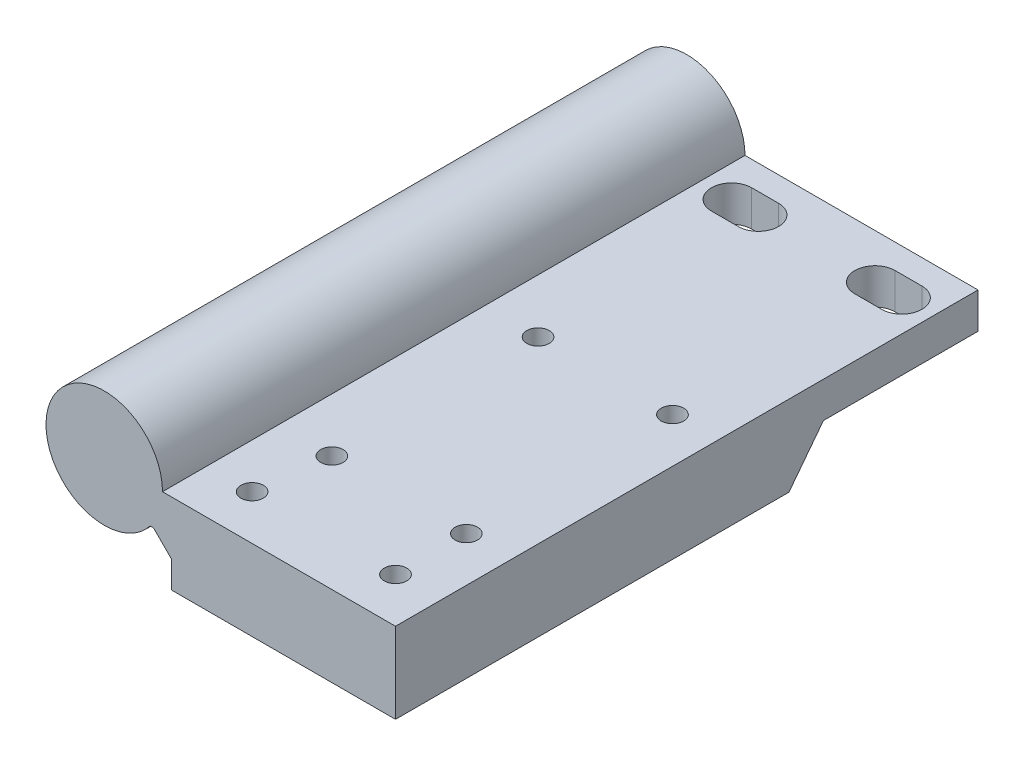
ISO-10303-21;
HEADER;
FILE_DESCRIPTION(('STEP AP214'),'2;1');
FILE_NAME('part.step','',(''),(''),'','','');
FILE_SCHEMA(('AUTOMOTIVE_DESIGN { 1 0 10303 214 1 1 1 1 }'));
ENDSEC;
DATA;
#1=APPLICATION_CONTEXT('core data for automotive mechanical design processes');
#2=APPLICATION_PROTOCOL_DEFINITION('international standard','automotive_design',2000,#1);
#3=PRODUCT_CONTEXT('',#1,'mechanical');
#4=PRODUCT('Part','Part','',(#3));
#5=PRODUCT_RELATED_PRODUCT_CATEGORY('part','',(#4));
#6=PRODUCT_DEFINITION_FORMATION('','',#4);
#7=PRODUCT_DEFINITION_CONTEXT('part definition',#1,'design');
#8=PRODUCT_DEFINITION('design','',#6,#7);
#9=PRODUCT_DEFINITION_SHAPE('','',#8);
#10=(LENGTH_UNIT() NAMED_UNIT(*) SI_UNIT(.MILLI.,.METRE.));
#11=(NAMED_UNIT(*) PLANE_ANGLE_UNIT() SI_UNIT($,.RADIAN.));
#12=(NAMED_UNIT(*) SI_UNIT($,.STERADIAN.) SOLID_ANGLE_UNIT());
#13=UNCERTAINTY_MEASURE_WITH_UNIT(LENGTH_MEASURE(1.E-05),#10,'distance_accuracy_value','');
#14=(GEOMETRIC_REPRESENTATION_CONTEXT(3) GLOBAL_UNCERTAINTY_ASSIGNED_CONTEXT((#13)) GLOBAL_UNIT_ASSIGNED_CONTEXT((#10,
#11,#12)) REPRESENTATION_CONTEXT('',''));
#15=CARTESIAN_POINT('',(0.,0.,0.));
#16=DIRECTION('',(0.,0.,1.));
#17=DIRECTION('',(1.,0.,0.));
#18=AXIS2_PLACEMENT_3D('',#15,#16,#17);
#19=CARTESIAN_POINT('',(0.,0.,65.));
#20=DIRECTION('',(0.,0.,-1.));
#21=DIRECTION('',(-1.,0.,0.));
#22=AXIS2_PLACEMENT_3D('',#19,#20,#21);
#23=CYLINDRICAL_SURFACE('',#22,4.1);
#24=CARTESIAN_POINT('',(0.,0.,0.));
#25=DIRECTION('',(0.,0.,1.));
#26=DIRECTION('',(1.,0.,0.));
#27=AXIS2_PLACEMENT_3D('',#24,#25,#26);
#28=CIRCLE('',#27,4.1);
#29=CARTESIAN_POINT('',(4.1,0.,0.));
#30=VERTEX_POINT('',#29);
#31=EDGE_CURVE('E276',#30,#30,#28,.T.);
#32=ORIENTED_EDGE('',*,*,#31,.F.);
#33=EDGE_LOOP('',(#32));
#34=FACE_BOUND('',#33,.T.);
#35=CARTESIAN_POINT('',(0.,0.,62.));
#36=DIRECTION('',(0.,0.,1.));
#37=DIRECTION('',(1.,0.,0.));
#38=AXIS2_PLACEMENT_3D('',#35,#36,#37);
#39=CIRCLE('',#38,4.1);
#40=CARTESIAN_POINT('',(4.1,0.,62.));
#41=VERTEX_POINT('',#40);
#42=EDGE_CURVE('E275',#41,#41,#39,.T.);
#43=ORIENTED_EDGE('',*,*,#42,.T.);
#44=EDGE_LOOP('',(#43));
#45=FACE_BOUND('',#44,.T.);
#46=ADVANCED_FACE('F44',(#34,#45),#23,.F.);
#47=CARTESIAN_POINT('',(0.,0.,65.));
#48=DIRECTION('',(0.,0.,1.));
#49=DIRECTION('',(1.,0.,0.));
#50=AXIS2_PLACEMENT_3D('',#47,#48,#49);
#51=PLANE('',#50);
#52=CARTESIAN_POINT('',(0.,0.,65.));
#53=DIRECTION('',(0.,0.,1.));
#54=DIRECTION('',(1.,0.,0.));
#55=AXIS2_PLACEMENT_3D('',#52,#53,#54);
#56=CIRCLE('',#55,6.5);
#57=CARTESIAN_POINT('',(6.5,0.,65.));
#58=VERTEX_POINT('',#57);
#59=CARTESIAN_POINT('',(5.1234753829798,-4.,65.));
#60=VERTEX_POINT('',#59);
#61=EDGE_CURVE('E280',#58,#60,#56,.T.);
#62=ORIENTED_EDGE('',*,*,#61,.T.);
#63=DIRECTION('',(1.,0.,0.));
#64=VECTOR('',#63,1.);
#65=CARTESIAN_POINT('',(5.1234753829798,-4.,65.));
#66=LINE('',#65,#64);
#67=CARTESIAN_POINT('',(5.500000000044,-4.,65.));
#68=VERTEX_POINT('',#67);
#69=EDGE_CURVE('E168',#60,#68,#66,.T.);
#70=ORIENTED_EDGE('',*,*,#69,.T.);
#71=DIRECTION('',(-0.707106781186551,0.707106781186544,0.));
#72=VECTOR('',#71,1.);
#73=CARTESIAN_POINT('',(5.500000000044,-4.,65.));
#74=LINE('',#73,#72);
#75=CARTESIAN_POINT('',(7.5,-5.99999999995599,65.));
#76=VERTEX_POINT('',#75);
#77=EDGE_CURVE('E53',#68,#76,#74,.F.);
#78=ORIENTED_EDGE('',*,*,#77,.T.);
#79=DIRECTION('',(0.,-1.,0.));
#80=VECTOR('',#79,1.);
#81=CARTESIAN_POINT('',(7.5,-8.99999999991197,65.));
#82=LINE('',#81,#80);
#83=CARTESIAN_POINT('',(7.5,-8.99999999991197,65.));
#84=VERTEX_POINT('',#83);
#85=EDGE_CURVE('E174',#76,#84,#82,.T.);
#86=ORIENTED_EDGE('',*,*,#85,.T.);
#87=DIRECTION('',(1.,0.,0.));
#88=VECTOR('',#87,1.);
#89=CARTESIAN_POINT('',(7.5,-8.99999999991197,65.));
#90=LINE('',#89,#88);
#91=CARTESIAN_POINT('',(32.5,-8.99999999991197,65.));
#92=VERTEX_POINT('',#91);
#93=EDGE_CURVE('E171',#84,#92,#90,.T.);
#94=ORIENTED_EDGE('',*,*,#93,.T.);
#95=DIRECTION('',(0.,1.,0.));
#96=VECTOR('',#95,1.);
#97=CARTESIAN_POINT('',(32.5,-4.,65.));
#98=LINE('',#97,#96);
#99=CARTESIAN_POINT('',(32.5,0.,65.));
#100=VERTEX_POINT('',#99);
#101=EDGE_CURVE('E158',#92,#100,#98,.T.);
#102=ORIENTED_EDGE('',*,*,#101,.T.);
#103=DIRECTION('',(-1.,0.,0.));
#104=VECTOR('',#103,1.);
#105=CARTESIAN_POINT('',(32.5,0.,65.));
#106=LINE('',#105,#104);
#107=EDGE_CURVE('E167',#100,#58,#106,.T.);
#108=ORIENTED_EDGE('',*,*,#107,.T.);
#109=EDGE_LOOP('',(#62,#70,#78,#86,#94,#102,#108));
#110=FACE_BOUND('',#109,.T.);
#111=ADVANCED_FACE('F173',(#110),#51,.T.);
#112=CARTESIAN_POINT('',(0.,0.,0.));
#113=DIRECTION('',(0.,0.,1.));
#114=DIRECTION('',(1.,0.,0.));
#115=AXIS2_PLACEMENT_3D('',#112,#113,#114);
#116=PLANE('',#115);
#117=CARTESIAN_POINT('',(0.,0.,0.));
#118=DIRECTION('',(0.,0.,1.));
#119=DIRECTION('',(1.,0.,0.));
#120=AXIS2_PLACEMENT_3D('',#117,#118,#119);
#121=CIRCLE('',#120,6.5);
#122=CARTESIAN_POINT('',(6.5,0.,0.));
#123=VERTEX_POINT('',#122);
#124=CARTESIAN_POINT('',(5.1234753829798,-4.,0.));
#125=VERTEX_POINT('',#124);
#126=EDGE_CURVE('E279',#123,#125,#121,.T.);
#127=ORIENTED_EDGE('',*,*,#126,.F.);
#128=DIRECTION('',(-1.,0.,0.));
#129=VECTOR('',#128,1.);
#130=CARTESIAN_POINT('',(32.5,0.,0.));
#131=LINE('',#130,#129);
#132=CARTESIAN_POINT('',(32.5,0.,0.));
#133=VERTEX_POINT('',#132);
#134=EDGE_CURVE('E282',#133,#123,#131,.T.);
#135=ORIENTED_EDGE('',*,*,#134,.F.);
#136=DIRECTION('',(0.,1.,0.));
#137=VECTOR('',#136,1.);
#138=CARTESIAN_POINT('',(32.5,-4.,0.));
#139=LINE('',#138,#137);
#140=CARTESIAN_POINT('',(32.5,-4.,0.));
#141=VERTEX_POINT('',#140);
#142=EDGE_CURVE('E291',#141,#133,#139,.T.);
#143=ORIENTED_EDGE('',*,*,#142,.F.);
#144=DIRECTION('',(1.,0.,0.));
#145=VECTOR('',#144,1.);
#146=CARTESIAN_POINT('',(5.1234753829798,-4.,0.));
#147=LINE('',#146,#145);
#148=EDGE_CURVE('E288',#125,#141,#147,.T.);
#149=ORIENTED_EDGE('',*,*,#148,.F.);
#150=EDGE_LOOP('',(#127,#135,#143,#149));
#151=FACE_BOUND('',#150,.T.);
#152=ORIENTED_EDGE('',*,*,#31,.T.);
#153=EDGE_LOOP('',(#152));
#154=FACE_BOUND('',#153,.T.);
#155=ADVANCED_FACE('F322',(#151,#154),#116,.F.);
#156=CARTESIAN_POINT('',(0.,0.,65.));
#157=DIRECTION('',(0.,0.,-1.));
#158=DIRECTION('',(-1.,0.,0.));
#159=AXIS2_PLACEMENT_3D('',#156,#157,#158);
#160=CYLINDRICAL_SURFACE('',#159,6.5);
#161=ORIENTED_EDGE('',*,*,#126,.T.);
#162=DIRECTION('',(0.,0.,-1.));
#163=VECTOR('',#162,1.);
#164=CARTESIAN_POINT('',(5.1234753829798,-4.,65.));
#165=LINE('',#164,#163);
#166=EDGE_CURVE('E299',#60,#125,#165,.T.);
#167=ORIENTED_EDGE('',*,*,#166,.F.);
#168=ORIENTED_EDGE('',*,*,#61,.F.);
#169=DIRECTION('',(0.,0.,-1.));
#170=VECTOR('',#169,1.);
#171=CARTESIAN_POINT('',(6.5,0.,65.));
#172=LINE('',#171,#170);
#173=EDGE_CURVE('E285',#58,#123,#172,.T.);
#174=ORIENTED_EDGE('',*,*,#173,.T.);
#175=EDGE_LOOP('',(#161,#167,#168,#174));
#176=FACE_BOUND('',#175,.T.);
#177=ADVANCED_FACE('F317',(#176),#160,.T.);
#178=CARTESIAN_POINT('',(5.1234753829798,-4.,65.));
#179=DIRECTION('',(0.,1.,0.));
#180=DIRECTION('',(0.,0.,1.));
#181=AXIS2_PLACEMENT_3D('',#178,#179,#180);
#182=PLANE('',#181);
#183=DIRECTION('',(-1.,0.,0.));
#184=VECTOR('',#183,1.);
#185=CARTESIAN_POINT('',(5.1234753829798,-4.,2.75));
#186=LINE('',#185,#184);
#187=CARTESIAN_POINT('',(29.,-4.,2.75));
#188=VERTEX_POINT('',#187);
#189=CARTESIAN_POINT('',(26.,-4.,2.75));
#190=VERTEX_POINT('',#189);
#191=EDGE_CURVE('E269',#188,#190,#186,.T.);
#192=ORIENTED_EDGE('',*,*,#191,.T.);
#193=CARTESIAN_POINT('',(26.,-4.,5.));
#194=DIRECTION('',(0.,1.,0.));
#195=DIRECTION('',(0.,0.,1.));
#196=AXIS2_PLACEMENT_3D('',#193,#194,#195);
#197=CIRCLE('',#196,2.25);
#198=CARTESIAN_POINT('',(26.,-4.,7.25));
#199=VERTEX_POINT('',#198);
#200=EDGE_CURVE('E272',#190,#199,#197,.T.);
#201=ORIENTED_EDGE('',*,*,#200,.T.);
#202=DIRECTION('',(1.,0.,0.));
#203=VECTOR('',#202,1.);
#204=CARTESIAN_POINT('',(5.1234753829798,-4.,7.25000000000001));
#205=LINE('',#204,#203);
#206=CARTESIAN_POINT('',(29.,-4.,7.25000000000001));
#207=VERTEX_POINT('',#206);
#208=EDGE_CURVE('E263',#199,#207,#205,.T.);
#209=ORIENTED_EDGE('',*,*,#208,.T.);
#210=CARTESIAN_POINT('',(29.,-4.,5.));
#211=DIRECTION('',(0.,1.,0.));
#212=DIRECTION('',(0.,0.,1.));
#213=AXIS2_PLACEMENT_3D('',#210,#211,#212);
#214=CIRCLE('',#213,2.25);
#215=EDGE_CURVE('E266',#207,#188,#214,.T.);
#216=ORIENTED_EDGE('',*,*,#215,.T.);
#217=EDGE_LOOP('',(#192,#201,#209,#216));
#218=FACE_BOUND('',#217,.T.);
#219=DIRECTION('',(-1.,0.,0.));
#220=VECTOR('',#219,1.);
#221=CARTESIAN_POINT('',(5.1234753829798,-4.,2.75));
#222=LINE('',#221,#220);
#223=CARTESIAN_POINT('',(13.,-4.,2.75));
#224=VERTEX_POINT('',#223);
#225=CARTESIAN_POINT('',(10.,-4.,2.75));
#226=VERTEX_POINT('',#225);
#227=EDGE_CURVE('E257',#224,#226,#222,.T.);
#228=ORIENTED_EDGE('',*,*,#227,.T.);
#229=CARTESIAN_POINT('',(10.,-4.,5.));
#230=DIRECTION('',(0.,1.,0.));
#231=DIRECTION('',(0.,0.,1.));
#232=AXIS2_PLACEMENT_3D('',#229,#230,#231);
#233=CIRCLE('',#232,2.25);
#234=CARTESIAN_POINT('',(10.,-4.,7.25));
#235=VERTEX_POINT('',#234);
#236=EDGE_CURVE('E260',#226,#235,#233,.T.);
#237=ORIENTED_EDGE('',*,*,#236,.T.);
#238=DIRECTION('',(1.,0.,0.));
#239=VECTOR('',#238,1.);
#240=CARTESIAN_POINT('',(5.1234753829798,-4.,7.25000000000001));
#241=LINE('',#240,#239);
#242=CARTESIAN_POINT('',(13.,-4.,7.25000000000001));
#243=VERTEX_POINT('',#242);
#244=EDGE_CURVE('E251',#235,#243,#241,.T.);
#245=ORIENTED_EDGE('',*,*,#244,.T.);
#246=CARTESIAN_POINT('',(13.,-4.,5.));
#247=DIRECTION('',(0.,1.,0.));
#248=DIRECTION('',(0.,0.,1.));
#249=AXIS2_PLACEMENT_3D('',#246,#247,#248);
#250=CIRCLE('',#249,2.25);
#251=EDGE_CURVE('E254',#243,#224,#250,.T.);
#252=ORIENTED_EDGE('',*,*,#251,.T.);
#253=EDGE_LOOP('',(#228,#237,#245,#252));
#254=FACE_BOUND('',#253,.T.);
#255=DIRECTION('',(1.,0.,0.));
#256=VECTOR('',#255,1.);
#257=CARTESIAN_POINT('',(7.5,-3.99999999991196,17.25));
#258=LINE('',#257,#256);
#259=CARTESIAN_POINT('',(5.500000000044,-3.99999999991196,17.25));
#260=VERTEX_POINT('',#259);
#261=CARTESIAN_POINT('',(32.5,-4.,17.25));
#262=VERTEX_POINT('',#261);
#263=EDGE_CURVE('E195',#260,#262,#258,.T.);
#264=ORIENTED_EDGE('',*,*,#263,.F.);
#265=DIRECTION('',(0.,0.,1.));
#266=VECTOR('',#265,1.);
#267=CARTESIAN_POINT('',(5.500000000044,-4.,65.));
#268=LINE('',#267,#266);
#269=EDGE_CURVE('E302',#260,#68,#268,.T.);
#270=ORIENTED_EDGE('',*,*,#269,.T.);
#271=ORIENTED_EDGE('',*,*,#69,.F.);
#272=ORIENTED_EDGE('',*,*,#166,.T.);
#273=ORIENTED_EDGE('',*,*,#148,.T.);
#274=DIRECTION('',(0.,0.,-1.));
#275=VECTOR('',#274,1.);
#276=CARTESIAN_POINT('',(32.5,-4.,65.));
#277=LINE('',#276,#275);
#278=EDGE_CURVE('E297',#262,#141,#277,.T.);
#279=ORIENTED_EDGE('',*,*,#278,.F.);
#280=EDGE_LOOP('',(#264,#270,#271,#272,#273,#279));
#281=FACE_BOUND('',#280,.T.);
#282=ADVANCED_FACE('F309',(#218,#254,#281),#182,.F.);
#283=CARTESIAN_POINT('',(32.5,-4.,65.));
#284=DIRECTION('',(-1.,0.,0.));
#285=DIRECTION('',(0.,0.,1.));
#286=AXIS2_PLACEMENT_3D('',#283,#284,#285);
#287=PLANE('',#286);
#288=ORIENTED_EDGE('',*,*,#142,.T.);
#289=DIRECTION('',(0.,0.,-1.));
#290=VECTOR('',#289,1.);
#291=CARTESIAN_POINT('',(32.5,0.,65.));
#292=LINE('',#291,#290);
#293=EDGE_CURVE('E165',#100,#133,#292,.T.);
#294=ORIENTED_EDGE('',*,*,#293,.F.);
#295=ORIENTED_EDGE('',*,*,#101,.F.);
#296=DIRECTION('',(0.,0.,-1.));
#297=VECTOR('',#296,1.);
#298=CARTESIAN_POINT('',(32.5,-8.99999999991196,21.0941842635777));
#299=LINE('',#298,#297);
#300=CARTESIAN_POINT('',(32.5,-8.99999999991196,21.0941842635777));
#301=VERTEX_POINT('',#300);
#302=EDGE_CURVE('E162',#92,#301,#299,.T.);
#303=ORIENTED_EDGE('',*,*,#302,.T.);
#304=DIRECTION('',(0.,0.79277488424877,-0.609514546917749));
#305=VECTOR('',#304,1.);
#306=CARTESIAN_POINT('',(32.5,-3.99999999991196,17.25));
#307=LINE('',#306,#305);
#308=EDGE_CURVE('E182',#301,#262,#307,.T.);
#309=ORIENTED_EDGE('',*,*,#308,.T.);
#310=ORIENTED_EDGE('',*,*,#278,.T.);
#311=EDGE_LOOP('',(#288,#294,#295,#303,#309,#310));
#312=FACE_BOUND('',#311,.T.);
#313=ADVANCED_FACE('F160',(#312),#287,.F.);
#314=CARTESIAN_POINT('',(32.5,0.,65.));
#315=DIRECTION('',(0.,-1.,0.));
#316=DIRECTION('',(1.,0.,0.));
#317=AXIS2_PLACEMENT_3D('',#314,#315,#316);
#318=PLANE('',#317);
#319=CARTESIAN_POINT('',(12.5,0.,29.0941842635778));
#320=DIRECTION('',(0.,-1.,0.));
#321=DIRECTION('',(1.,0.,0.));
#322=AXIS2_PLACEMENT_3D('',#319,#320,#321);
#323=CIRCLE('',#322,1.25);
#324=CARTESIAN_POINT('',(13.75,0.,29.0941842635778));
#325=VERTEX_POINT('',#324);
#326=EDGE_CURVE('E183',#325,#325,#323,.T.);
#327=ORIENTED_EDGE('',*,*,#326,.T.);
#328=EDGE_LOOP('',(#327));
#329=FACE_BOUND('',#328,.T.);
#330=CARTESIAN_POINT('',(27.5,0.,52.0941842635778));
#331=DIRECTION('',(0.,-1.,0.));
#332=DIRECTION('',(1.,0.,0.));
#333=AXIS2_PLACEMENT_3D('',#330,#331,#332);
#334=CIRCLE('',#333,1.25);
#335=CARTESIAN_POINT('',(28.75,0.,52.0941842635778));
#336=VERTEX_POINT('',#335);
#337=EDGE_CURVE('E187',#336,#336,#334,.T.);
#338=ORIENTED_EDGE('',*,*,#337,.T.);
#339=EDGE_LOOP('',(#338));
#340=FACE_BOUND('',#339,.T.);
#341=CARTESIAN_POINT('',(12.5,0.,52.0941842635778));
#342=DIRECTION('',(0.,-1.,0.));
#343=DIRECTION('',(1.,0.,0.));
#344=AXIS2_PLACEMENT_3D('',#341,#342,#343);
#345=CIRCLE('',#344,1.25);
#346=CARTESIAN_POINT('',(13.75,0.,52.0941842635778));
#347=VERTEX_POINT('',#346);
#348=EDGE_CURVE('E460',#347,#347,#345,.T.);
#349=ORIENTED_EDGE('',*,*,#348,.T.);
#350=EDGE_LOOP('',(#349));
#351=FACE_BOUND('',#350,.T.);
#352=CARTESIAN_POINT('',(27.5,0.,29.0941842635778));
#353=DIRECTION('',(0.,-1.,0.));
#354=DIRECTION('',(1.,0.,0.));
#355=AXIS2_PLACEMENT_3D('',#352,#353,#354);
#356=CIRCLE('',#355,1.25);
#357=CARTESIAN_POINT('',(28.75,0.,29.0941842635778));
#358=VERTEX_POINT('',#357);
#359=EDGE_CURVE('E462',#358,#358,#356,.T.);
#360=ORIENTED_EDGE('',*,*,#359,.T.);
#361=EDGE_LOOP('',(#360));
#362=FACE_BOUND('',#361,.T.);
#363=DIRECTION('',(1.,0.,0.));
#364=VECTOR('',#363,1.);
#365=CARTESIAN_POINT('',(26.,0.,7.25));
#366=LINE('',#365,#364);
#367=CARTESIAN_POINT('',(26.,0.,7.25000000000001));
#368=VERTEX_POINT('',#367);
#369=CARTESIAN_POINT('',(29.,0.,7.25));
#370=VERTEX_POINT('',#369);
#371=EDGE_CURVE('E239',#368,#370,#366,.T.);
#372=ORIENTED_EDGE('',*,*,#371,.F.);
#373=CARTESIAN_POINT('',(26.,0.,5.));
#374=DIRECTION('',(0.,1.,0.));
#375=DIRECTION('',(-1.,0.,0.));
#376=AXIS2_PLACEMENT_3D('',#373,#374,#375);
#377=CIRCLE('',#376,2.25);
#378=CARTESIAN_POINT('',(26.,0.,2.75));
#379=VERTEX_POINT('',#378);
#380=EDGE_CURVE('E215',#379,#368,#377,.T.);
#381=ORIENTED_EDGE('',*,*,#380,.F.);
#382=DIRECTION('',(-1.,0.,0.));
#383=VECTOR('',#382,1.);
#384=CARTESIAN_POINT('',(26.,0.,2.75));
#385=LINE('',#384,#383);
#386=CARTESIAN_POINT('',(29.,0.,2.75));
#387=VERTEX_POINT('',#386);
#388=EDGE_CURVE('E228',#387,#379,#385,.T.);
#389=ORIENTED_EDGE('',*,*,#388,.F.);
#390=CARTESIAN_POINT('',(29.,0.,5.));
#391=DIRECTION('',(0.,1.,0.));
#392=DIRECTION('',(-1.,0.,0.));
#393=AXIS2_PLACEMENT_3D('',#390,#391,#392);
#394=CIRCLE('',#393,2.25);
#395=EDGE_CURVE('E236',#370,#387,#394,.T.);
#396=ORIENTED_EDGE('',*,*,#395,.F.);
#397=EDGE_LOOP('',(#372,#381,#389,#396));
#398=FACE_BOUND('',#397,.T.);
#399=DIRECTION('',(1.,0.,0.));
#400=VECTOR('',#399,1.);
#401=CARTESIAN_POINT('',(10.,0.,7.25));
#402=LINE('',#401,#400);
#403=CARTESIAN_POINT('',(10.,0.,7.25000000000001));
#404=VERTEX_POINT('',#403);
#405=CARTESIAN_POINT('',(13.,0.,7.25));
#406=VERTEX_POINT('',#405);
#407=EDGE_CURVE('E221',#404,#406,#402,.T.);
#408=ORIENTED_EDGE('',*,*,#407,.F.);
#409=CARTESIAN_POINT('',(10.,0.,5.));
#410=DIRECTION('',(0.,1.,0.));
#411=DIRECTION('',(-1.,0.,0.));
#412=AXIS2_PLACEMENT_3D('',#409,#410,#411);
#413=CIRCLE('',#412,2.25);
#414=CARTESIAN_POINT('',(10.,0.,2.75));
#415=VERTEX_POINT('',#414);
#416=EDGE_CURVE('E204',#415,#404,#413,.T.);
#417=ORIENTED_EDGE('',*,*,#416,.F.);
#418=DIRECTION('',(-1.,0.,0.));
#419=VECTOR('',#418,1.);
#420=CARTESIAN_POINT('',(10.,0.,2.75));
#421=LINE('',#420,#419);
#422=CARTESIAN_POINT('',(13.,0.,2.75));
#423=VERTEX_POINT('',#422);
#424=EDGE_CURVE('E208',#423,#415,#421,.T.);
#425=ORIENTED_EDGE('',*,*,#424,.F.);
#426=CARTESIAN_POINT('',(13.,0.,5.));
#427=DIRECTION('',(0.,1.,0.));
#428=DIRECTION('',(-1.,0.,0.));
#429=AXIS2_PLACEMENT_3D('',#426,#427,#428);
#430=CIRCLE('',#429,2.25);
#431=EDGE_CURVE('E218',#406,#423,#430,.T.);
#432=ORIENTED_EDGE('',*,*,#431,.F.);
#433=EDGE_LOOP('',(#408,#417,#425,#432));
#434=FACE_BOUND('',#433,.T.);
#435=CARTESIAN_POINT('',(11.5,0.,60.));
#436=DIRECTION('',(0.,1.,0.));
#437=DIRECTION('',(-1.,0.,0.));
#438=AXIS2_PLACEMENT_3D('',#435,#436,#437);
#439=CIRCLE('',#438,1.25);
#440=CARTESIAN_POINT('',(10.25,0.,60.));
#441=VERTEX_POINT('',#440);
#442=EDGE_CURVE('E200',#441,#441,#439,.T.);
#443=ORIENTED_EDGE('',*,*,#442,.F.);
#444=EDGE_LOOP('',(#443));
#445=FACE_BOUND('',#444,.T.);
#446=CARTESIAN_POINT('',(27.5,0.,60.));
#447=DIRECTION('',(0.,1.,0.));
#448=DIRECTION('',(-1.,0.,0.));
#449=AXIS2_PLACEMENT_3D('',#446,#447,#448);
#450=CIRCLE('',#449,1.25);
#451=CARTESIAN_POINT('',(26.25,0.,60.));
#452=VERTEX_POINT('',#451);
#453=EDGE_CURVE('E203',#452,#452,#450,.T.);
#454=ORIENTED_EDGE('',*,*,#453,.F.);
#455=EDGE_LOOP('',(#454));
#456=FACE_BOUND('',#455,.T.);
#457=ORIENTED_EDGE('',*,*,#134,.T.);
#458=ORIENTED_EDGE('',*,*,#173,.F.);
#459=ORIENTED_EDGE('',*,*,#107,.F.);
#460=ORIENTED_EDGE('',*,*,#293,.T.);
#461=EDGE_LOOP('',(#457,#458,#459,#460));
#462=FACE_BOUND('',#461,.T.);
#463=ADVANCED_FACE('F325',(#329,#340,#351,#362,#398,#434,#445,#456,#462),#318,.F.);
#464=CARTESIAN_POINT('',(0.,0.,62.));
#465=DIRECTION('',(0.,0.,1.));
#466=DIRECTION('',(1.,0.,0.));
#467=AXIS2_PLACEMENT_3D('',#464,#465,#466);
#468=PLANE('',#467);
#469=ORIENTED_EDGE('',*,*,#42,.F.);
#470=EDGE_LOOP('',(#469));
#471=FACE_BOUND('',#470,.T.);
#472=ADVANCED_FACE('F327',(#471),#468,.F.);
#473=CARTESIAN_POINT('',(27.5,-13.,60.));
#474=DIRECTION('',(0.,1.,0.));
#475=DIRECTION('',(-1.,0.,0.));
#476=AXIS2_PLACEMENT_3D('',#473,#474,#475);
#477=CYLINDRICAL_SURFACE('',#476,1.25);
#478=ORIENTED_EDGE('',*,*,#453,.T.);
#479=EDGE_LOOP('',(#478));
#480=FACE_BOUND('',#479,.T.);
#481=CARTESIAN_POINT('',(27.5,-4.,60.));
#482=DIRECTION('',(0.,1.,0.));
#483=DIRECTION('',(0.,0.,1.));
#484=AXIS2_PLACEMENT_3D('',#481,#482,#483);
#485=CIRCLE('',#484,1.25);
#486=CARTESIAN_POINT('',(27.5,-4.,61.25));
#487=VERTEX_POINT('',#486);
#488=EDGE_CURVE('E245',#487,#487,#485,.T.);
#489=ORIENTED_EDGE('',*,*,#488,.F.);
#490=EDGE_LOOP('',(#489));
#491=FACE_BOUND('',#490,.T.);
#492=ADVANCED_FACE('F335',(#480,#491),#477,.F.);
#493=CARTESIAN_POINT('',(11.5,-13.,60.));
#494=DIRECTION('',(0.,1.,0.));
#495=DIRECTION('',(-1.,0.,0.));
#496=AXIS2_PLACEMENT_3D('',#493,#494,#495);
#497=CYLINDRICAL_SURFACE('',#496,1.25);
#498=ORIENTED_EDGE('',*,*,#442,.T.);
#499=EDGE_LOOP('',(#498));
#500=FACE_BOUND('',#499,.T.);
#501=CARTESIAN_POINT('',(11.5,-4.,60.));
#502=DIRECTION('',(0.,1.,0.));
#503=DIRECTION('',(0.,0.,1.));
#504=AXIS2_PLACEMENT_3D('',#501,#502,#503);
#505=CIRCLE('',#504,1.25);
#506=CARTESIAN_POINT('',(11.5,-4.,61.25));
#507=VERTEX_POINT('',#506);
#508=EDGE_CURVE('E248',#507,#507,#505,.T.);
#509=ORIENTED_EDGE('',*,*,#508,.F.);
#510=EDGE_LOOP('',(#509));
#511=FACE_BOUND('',#510,.T.);
#512=ADVANCED_FACE('F411',(#500,#511),#497,.F.);
#513=CARTESIAN_POINT('',(10.,-13.,5.));
#514=DIRECTION('',(0.,1.,0.));
#515=DIRECTION('',(-1.,0.,0.));
#516=AXIS2_PLACEMENT_3D('',#513,#514,#515);
#517=CYLINDRICAL_SURFACE('',#516,2.25);
#518=DIRECTION('',(0.,1.,0.));
#519=VECTOR('',#518,1.);
#520=CARTESIAN_POINT('',(10.,-13.,2.75));
#521=LINE('',#520,#519);
#522=EDGE_CURVE('E213',#226,#415,#521,.T.);
#523=ORIENTED_EDGE('',*,*,#522,.T.);
#524=ORIENTED_EDGE('',*,*,#416,.T.);
#525=DIRECTION('',(0.,1.,0.));
#526=VECTOR('',#525,1.);
#527=CARTESIAN_POINT('',(10.,-13.,7.25));
#528=LINE('',#527,#526);
#529=EDGE_CURVE('E205',#235,#404,#528,.T.);
#530=ORIENTED_EDGE('',*,*,#529,.F.);
#531=ORIENTED_EDGE('',*,*,#236,.F.);
#532=EDGE_LOOP('',(#523,#524,#530,#531));
#533=FACE_BOUND('',#532,.T.);
#534=ADVANCED_FACE('F380',(#533),#517,.F.);
#535=CARTESIAN_POINT('',(10.,-13.,2.75));
#536=DIRECTION('',(0.,0.,-1.));
#537=DIRECTION('',(-1.,0.,0.));
#538=AXIS2_PLACEMENT_3D('',#535,#536,#537);
#539=PLANE('',#538);
#540=DIRECTION('',(0.,1.,0.));
#541=VECTOR('',#540,1.);
#542=CARTESIAN_POINT('',(13.,-13.,2.75));
#543=LINE('',#542,#541);
#544=EDGE_CURVE('E211',#224,#423,#543,.T.);
#545=ORIENTED_EDGE('',*,*,#544,.T.);
#546=ORIENTED_EDGE('',*,*,#424,.T.);
#547=ORIENTED_EDGE('',*,*,#522,.F.);
#548=ORIENTED_EDGE('',*,*,#227,.F.);
#549=EDGE_LOOP('',(#545,#546,#547,#548));
#550=FACE_BOUND('',#549,.T.);
#551=ADVANCED_FACE('F369',(#550),#539,.F.);
#552=CARTESIAN_POINT('',(13.,-13.,5.));
#553=DIRECTION('',(0.,1.,0.));
#554=DIRECTION('',(-1.,0.,0.));
#555=AXIS2_PLACEMENT_3D('',#552,#553,#554);
#556=CYLINDRICAL_SURFACE('',#555,2.25);
#557=DIRECTION('',(0.,1.,0.));
#558=VECTOR('',#557,1.);
#559=CARTESIAN_POINT('',(13.,-13.,7.25));
#560=LINE('',#559,#558);
#561=EDGE_CURVE('E209',#243,#406,#560,.T.);
#562=ORIENTED_EDGE('',*,*,#561,.T.);
#563=ORIENTED_EDGE('',*,*,#431,.T.);
#564=ORIENTED_EDGE('',*,*,#544,.F.);
#565=ORIENTED_EDGE('',*,*,#251,.F.);
#566=EDGE_LOOP('',(#562,#563,#564,#565));
#567=FACE_BOUND('',#566,.T.);
#568=ADVANCED_FACE('F371',(#567),#556,.F.);
#569=CARTESIAN_POINT('',(10.,-13.,7.25));
#570=DIRECTION('',(0.,0.,1.));
#571=DIRECTION('',(1.,0.,0.));
#572=AXIS2_PLACEMENT_3D('',#569,#570,#571);
#573=PLANE('',#572);
#574=ORIENTED_EDGE('',*,*,#529,.T.);
#575=ORIENTED_EDGE('',*,*,#407,.T.);
#576=ORIENTED_EDGE('',*,*,#561,.F.);
#577=ORIENTED_EDGE('',*,*,#244,.F.);
#578=EDGE_LOOP('',(#574,#575,#576,#577));
#579=FACE_BOUND('',#578,.T.);
#580=ADVANCED_FACE('F382',(#579),#573,.F.);
#581=CARTESIAN_POINT('',(26.,-13.,5.));
#582=DIRECTION('',(0.,1.,0.));
#583=DIRECTION('',(-1.,0.,0.));
#584=AXIS2_PLACEMENT_3D('',#581,#582,#583);
#585=CYLINDRICAL_SURFACE('',#584,2.25);
#586=DIRECTION('',(0.,1.,0.));
#587=VECTOR('',#586,1.);
#588=CARTESIAN_POINT('',(26.,-13.,2.75));
#589=LINE('',#588,#587);
#590=EDGE_CURVE('E198',#190,#379,#589,.T.);
#591=ORIENTED_EDGE('',*,*,#590,.T.);
#592=ORIENTED_EDGE('',*,*,#380,.T.);
#593=DIRECTION('',(0.,1.,0.));
#594=VECTOR('',#593,1.);
#595=CARTESIAN_POINT('',(26.,-13.,7.25));
#596=LINE('',#595,#594);
#597=EDGE_CURVE('E225',#199,#368,#596,.T.);
#598=ORIENTED_EDGE('',*,*,#597,.F.);
#599=ORIENTED_EDGE('',*,*,#200,.F.);
#600=EDGE_LOOP('',(#591,#592,#598,#599));
#601=FACE_BOUND('',#600,.T.);
#602=ADVANCED_FACE('F384',(#601),#585,.F.);
#603=CARTESIAN_POINT('',(26.,-13.,2.75));
#604=DIRECTION('',(0.,0.,-1.));
#605=DIRECTION('',(-1.,0.,0.));
#606=AXIS2_PLACEMENT_3D('',#603,#604,#605);
#607=PLANE('',#606);
#608=DIRECTION('',(0.,1.,0.));
#609=VECTOR('',#608,1.);
#610=CARTESIAN_POINT('',(29.,-13.,2.75));
#611=LINE('',#610,#609);
#612=EDGE_CURVE('E231',#188,#387,#611,.T.);
#613=ORIENTED_EDGE('',*,*,#612,.T.);
#614=ORIENTED_EDGE('',*,*,#388,.T.);
#615=ORIENTED_EDGE('',*,*,#590,.F.);
#616=ORIENTED_EDGE('',*,*,#191,.F.);
#617=EDGE_LOOP('',(#613,#614,#615,#616));
#618=FACE_BOUND('',#617,.T.);
#619=ADVANCED_FACE('F390',(#618),#607,.F.);
#620=CARTESIAN_POINT('',(29.,-13.,5.));
#621=DIRECTION('',(0.,1.,0.));
#622=DIRECTION('',(-1.,0.,0.));
#623=AXIS2_PLACEMENT_3D('',#620,#621,#622);
#624=CYLINDRICAL_SURFACE('',#623,2.25);
#625=DIRECTION('',(0.,1.,0.));
#626=VECTOR('',#625,1.);
#627=CARTESIAN_POINT('',(29.,-13.,7.25));
#628=LINE('',#627,#626);
#629=EDGE_CURVE('E229',#207,#370,#628,.T.);
#630=ORIENTED_EDGE('',*,*,#629,.T.);
#631=ORIENTED_EDGE('',*,*,#395,.T.);
#632=ORIENTED_EDGE('',*,*,#612,.F.);
#633=ORIENTED_EDGE('',*,*,#215,.F.);
#634=EDGE_LOOP('',(#630,#631,#632,#633));
#635=FACE_BOUND('',#634,.T.);
#636=ADVANCED_FACE('F403',(#635),#624,.F.);
#637=CARTESIAN_POINT('',(26.,-13.,7.25));
#638=DIRECTION('',(0.,0.,1.));
#639=DIRECTION('',(1.,0.,0.));
#640=AXIS2_PLACEMENT_3D('',#637,#638,#639);
#641=PLANE('',#640);
#642=ORIENTED_EDGE('',*,*,#597,.T.);
#643=ORIENTED_EDGE('',*,*,#371,.T.);
#644=ORIENTED_EDGE('',*,*,#629,.F.);
#645=ORIENTED_EDGE('',*,*,#208,.F.);
#646=EDGE_LOOP('',(#642,#643,#644,#645));
#647=FACE_BOUND('',#646,.T.);
#648=ADVANCED_FACE('F399',(#647),#641,.F.);
#649=CARTESIAN_POINT('',(7.5,-4.,65.));
#650=DIRECTION('',(0.,1.,1.84385665549166E-12));
#651=DIRECTION('',(0.,-1.84385665549166E-12,1.));
#652=AXIS2_PLACEMENT_3D('',#649,#650,#651);
#653=PLANE('',#652);
#654=ORIENTED_EDGE('',*,*,#508,.T.);
#655=EDGE_LOOP('',(#654));
#656=FACE_BOUND('',#655,.T.);
#657=ADVANCED_FACE('F402',(#656),#653,.T.);
#658=ORIENTED_EDGE('',*,*,#488,.T.);
#659=EDGE_LOOP('',(#658));
#660=FACE_BOUND('',#659,.T.);
#661=ADVANCED_FACE('F421',(#660),#653,.T.);
#662=CARTESIAN_POINT('',(7.5,-3.99999999991196,17.25));
#663=DIRECTION('',(0.,-0.609514546917749,-0.79277488424877));
#664=DIRECTION('',(0.,0.792774884248771,-0.609514546917749));
#665=AXIS2_PLACEMENT_3D('',#662,#663,#664);
#666=PLANE('',#665);
#667=ORIENTED_EDGE('',*,*,#263,.T.);
#668=ORIENTED_EDGE('',*,*,#308,.F.);
#669=DIRECTION('',(1.,0.,0.));
#670=VECTOR('',#669,1.);
#671=CARTESIAN_POINT('',(7.5,-8.99999999991196,21.0941842635777));
#672=LINE('',#671,#670);
#673=CARTESIAN_POINT('',(7.5,-8.99999999991196,21.0941842635777));
#674=VERTEX_POINT('',#673);
#675=EDGE_CURVE('E178',#674,#301,#672,.T.);
#676=ORIENTED_EDGE('',*,*,#675,.F.);
#677=DIRECTION('',(0.,0.79277488424877,-0.609514546917749));
#678=VECTOR('',#677,1.);
#679=CARTESIAN_POINT('',(7.5,-3.99999999991196,17.25));
#680=LINE('',#679,#678);
#681=CARTESIAN_POINT('',(7.5,-5.99999999995599,18.7876737054649));
#682=VERTEX_POINT('',#681);
#683=EDGE_CURVE('E179',#674,#682,#680,.T.);
#684=ORIENTED_EDGE('',*,*,#683,.T.);
#685=DIRECTION('',(0.621236645401878,-0.621236645401872,0.477629627242333));
#686=VECTOR('',#685,1.);
#687=CARTESIAN_POINT('',(19.6684290570644,-18.1684290570203,28.1432104041906));
#688=LINE('',#687,#686);
#689=EDGE_CURVE('E11',#682,#260,#688,.F.);
#690=ORIENTED_EDGE('',*,*,#689,.T.);
#691=EDGE_LOOP('',(#667,#668,#676,#684,#690));
#692=FACE_BOUND('',#691,.T.);
#693=ADVANCED_FACE('F423',(#692),#666,.T.);
#694=CARTESIAN_POINT('',(7.5,-8.99999999991196,21.0941842635777));
#695=DIRECTION('',(0.,-1.,0.));
#696=DIRECTION('',(0.,0.,-1.));
#697=AXIS2_PLACEMENT_3D('',#694,#695,#696);
#698=PLANE('',#697);
#699=CARTESIAN_POINT('',(12.5,-8.99999999991196,29.0941842635778));
#700=DIRECTION('',(0.,-1.,0.));
#701=DIRECTION('',(0.,0.,-1.));
#702=AXIS2_PLACEMENT_3D('',#699,#700,#701);
#703=CIRCLE('',#702,1.25);
#704=CARTESIAN_POINT('',(12.5,-8.99999999991196,27.8441842635778));
#705=VERTEX_POINT('',#704);
#706=EDGE_CURVE('E471',#705,#705,#703,.T.);
#707=ORIENTED_EDGE('',*,*,#706,.F.);
#708=EDGE_LOOP('',(#707));
#709=FACE_BOUND('',#708,.T.);
#710=CARTESIAN_POINT('',(27.5,-8.99999999991196,52.0941842635778));
#711=DIRECTION('',(0.,-1.,0.));
#712=DIRECTION('',(0.,0.,-1.));
#713=AXIS2_PLACEMENT_3D('',#710,#711,#712);
#714=CIRCLE('',#713,1.25);
#715=CARTESIAN_POINT('',(27.5,-8.99999999991196,50.8441842635778));
#716=VERTEX_POINT('',#715);
#717=EDGE_CURVE('E472',#716,#716,#714,.T.);
#718=ORIENTED_EDGE('',*,*,#717,.F.);
#719=EDGE_LOOP('',(#718));
#720=FACE_BOUND('',#719,.T.);
#721=CARTESIAN_POINT('',(12.5,-8.99999999991196,52.0941842635778));
#722=DIRECTION('',(0.,-1.,0.));
#723=DIRECTION('',(0.,0.,-1.));
#724=AXIS2_PLACEMENT_3D('',#721,#722,#723);
#725=CIRCLE('',#724,1.25);
#726=CARTESIAN_POINT('',(12.5,-8.99999999991196,50.8441842635778));
#727=VERTEX_POINT('',#726);
#728=EDGE_CURVE('E457',#727,#727,#725,.T.);
#729=ORIENTED_EDGE('',*,*,#728,.F.);
#730=EDGE_LOOP('',(#729));
#731=FACE_BOUND('',#730,.T.);
#732=CARTESIAN_POINT('',(27.5,-8.99999999991196,29.0941842635778));
#733=DIRECTION('',(0.,-1.,0.));
#734=DIRECTION('',(0.,0.,-1.));
#735=AXIS2_PLACEMENT_3D('',#732,#733,#734);
#736=CIRCLE('',#735,1.25);
#737=CARTESIAN_POINT('',(27.5,-8.99999999991196,27.8441842635778));
#738=VERTEX_POINT('',#737);
#739=EDGE_CURVE('E466',#738,#738,#736,.T.);
#740=ORIENTED_EDGE('',*,*,#739,.F.);
#741=EDGE_LOOP('',(#740));
#742=FACE_BOUND('',#741,.T.);
#743=ORIENTED_EDGE('',*,*,#675,.T.);
#744=ORIENTED_EDGE('',*,*,#302,.F.);
#745=ORIENTED_EDGE('',*,*,#93,.F.);
#746=DIRECTION('',(0.,0.,-1.));
#747=VECTOR('',#746,1.);
#748=CARTESIAN_POINT('',(7.5,-8.99999999991196,21.0941842635777));
#749=LINE('',#748,#747);
#750=EDGE_CURVE('E192',#84,#674,#749,.T.);
#751=ORIENTED_EDGE('',*,*,#750,.T.);
#752=EDGE_LOOP('',(#743,#744,#745,#751));
#753=FACE_BOUND('',#752,.T.);
#754=ADVANCED_FACE('F181',(#709,#720,#731,#742,#753),#698,.T.);
#755=CARTESIAN_POINT('',(7.5,0.,0.));
#756=DIRECTION('',(1.,0.,0.));
#757=DIRECTION('',(0.,0.,-1.));
#758=AXIS2_PLACEMENT_3D('',#755,#756,#757);
#759=PLANE('',#758);
#760=ORIENTED_EDGE('',*,*,#85,.F.);
#761=DIRECTION('',(0.,0.,-1.));
#762=VECTOR('',#761,1.);
#763=CARTESIAN_POINT('',(7.5,-5.99999999995599,17.25));
#764=LINE('',#763,#762);
#765=EDGE_CURVE('E66',#76,#682,#764,.T.);
#766=ORIENTED_EDGE('',*,*,#765,.T.);
#767=ORIENTED_EDGE('',*,*,#683,.F.);
#768=ORIENTED_EDGE('',*,*,#750,.F.);
#769=EDGE_LOOP('',(#760,#766,#767,#768));
#770=FACE_BOUND('',#769,.T.);
#771=ADVANCED_FACE('F432',(#770),#759,.F.);
#772=CARTESIAN_POINT('',(5.500000000044,-4.,65.));
#773=DIRECTION('',(-0.707106781186544,-0.707106781186551,0.));
#774=DIRECTION('',(0.,0.,-1.));
#775=AXIS2_PLACEMENT_3D('',#772,#773,#774);
#776=PLANE('',#775);
#777=ORIENTED_EDGE('',*,*,#689,.F.);
#778=ORIENTED_EDGE('',*,*,#765,.F.);
#779=ORIENTED_EDGE('',*,*,#77,.F.);
#780=ORIENTED_EDGE('',*,*,#269,.F.);
#781=EDGE_LOOP('',(#777,#778,#779,#780));
#782=FACE_BOUND('',#781,.T.);
#783=ADVANCED_FACE('F47',(#782),#776,.T.);
#784=CARTESIAN_POINT('',(27.5,1.00000000008804,29.0941842635778));
#785=DIRECTION('',(0.,-1.,0.));
#786=DIRECTION('',(0.,0.,-1.));
#787=AXIS2_PLACEMENT_3D('',#784,#785,#786);
#788=CYLINDRICAL_SURFACE('',#787,1.25);
#789=ORIENTED_EDGE('',*,*,#739,.T.);
#790=EDGE_LOOP('',(#789));
#791=FACE_BOUND('',#790,.T.);
#792=ORIENTED_EDGE('',*,*,#359,.F.);
#793=EDGE_LOOP('',(#792));
#794=FACE_BOUND('',#793,.T.);
#795=ADVANCED_FACE('F437',(#791,#794),#788,.F.);
#796=CARTESIAN_POINT('',(12.5,1.00000000008804,52.0941842635778));
#797=DIRECTION('',(0.,-1.,0.));
#798=DIRECTION('',(0.,0.,-1.));
#799=AXIS2_PLACEMENT_3D('',#796,#797,#798);
#800=CYLINDRICAL_SURFACE('',#799,1.25);
#801=ORIENTED_EDGE('',*,*,#728,.T.);
#802=EDGE_LOOP('',(#801));
#803=FACE_BOUND('',#802,.T.);
#804=ORIENTED_EDGE('',*,*,#348,.F.);
#805=EDGE_LOOP('',(#804));
#806=FACE_BOUND('',#805,.T.);
#807=ADVANCED_FACE('F440',(#803,#806),#800,.F.);
#808=CARTESIAN_POINT('',(27.5,1.00000000008804,52.0941842635778));
#809=DIRECTION('',(0.,-1.,0.));
#810=DIRECTION('',(0.,0.,-1.));
#811=AXIS2_PLACEMENT_3D('',#808,#809,#810);
#812=CYLINDRICAL_SURFACE('',#811,1.25);
#813=ORIENTED_EDGE('',*,*,#717,.T.);
#814=EDGE_LOOP('',(#813));
#815=FACE_BOUND('',#814,.T.);
#816=ORIENTED_EDGE('',*,*,#337,.F.);
#817=EDGE_LOOP('',(#816));
#818=FACE_BOUND('',#817,.T.);
#819=ADVANCED_FACE('F442',(#815,#818),#812,.F.);
#820=CARTESIAN_POINT('',(12.5,1.00000000008804,29.0941842635778));
#821=DIRECTION('',(0.,-1.,0.));
#822=DIRECTION('',(0.,0.,-1.));
#823=AXIS2_PLACEMENT_3D('',#820,#821,#822);
#824=CYLINDRICAL_SURFACE('',#823,1.25);
#825=ORIENTED_EDGE('',*,*,#706,.T.);
#826=EDGE_LOOP('',(#825));
#827=FACE_BOUND('',#826,.T.);
#828=ORIENTED_EDGE('',*,*,#326,.F.);
#829=EDGE_LOOP('',(#828));
#830=FACE_BOUND('',#829,.T.);
#831=ADVANCED_FACE('F445',(#827,#830),#824,.F.);
#832=CLOSED_SHELL('',(#46,#111,#155,#177,#282,#313,#463,#472,#492,#512,#534,#551,#568,#580,#602,
#619,#636,#648,#657,#661,#693,#754,#771,#783,#795,#807,#819,#831));
#833=MANIFOLD_SOLID_BREP('B2',#832);
#834=ADVANCED_BREP_SHAPE_REPRESENTATION('',(#18,#833),#14);
#835=SHAPE_DEFINITION_REPRESENTATION(#9,#834);
ENDSEC;
END-ISO-10303-21;
